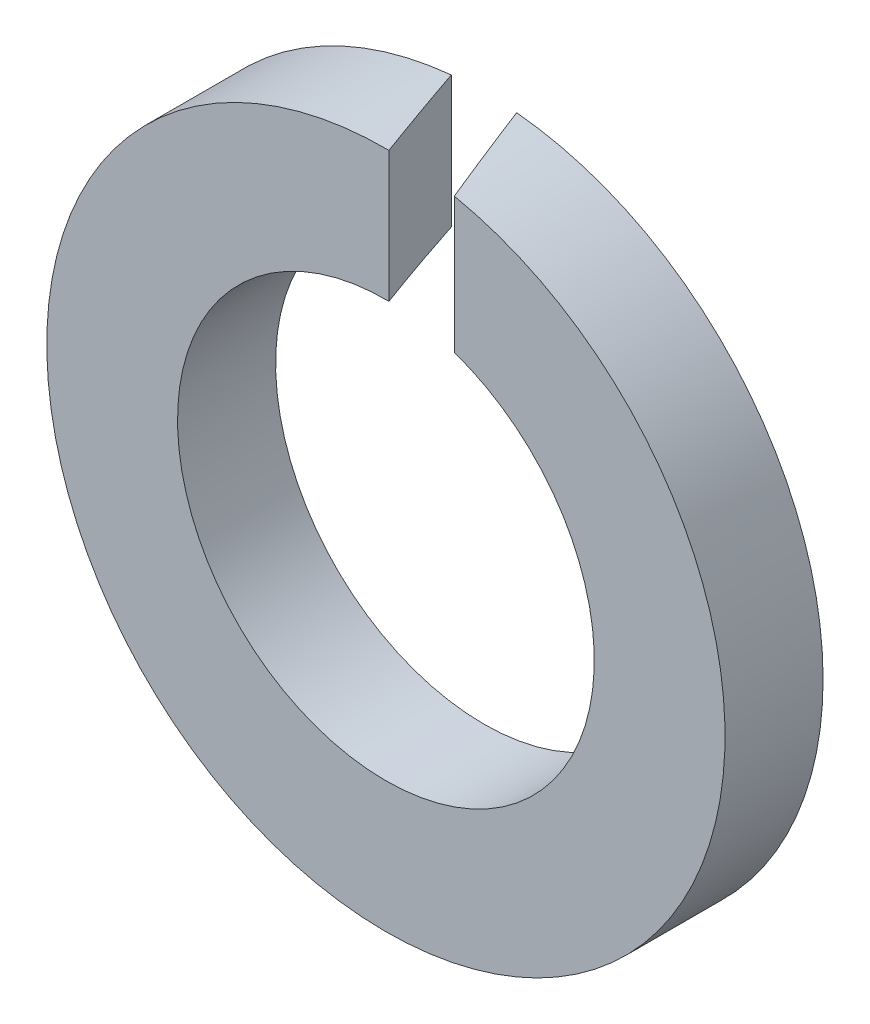
ISO-10303-21;
HEADER;
FILE_DESCRIPTION(('STEP AP214'),'2;1');
FILE_NAME('part.step','',(''),(''),'','','');
FILE_SCHEMA(('AUTOMOTIVE_DESIGN { 1 0 10303 214 1 1 1 1 }'));
ENDSEC;
DATA;
#1=APPLICATION_CONTEXT('core data for automotive mechanical design processes');
#2=APPLICATION_PROTOCOL_DEFINITION('international standard','automotive_design',2000,#1);
#3=PRODUCT_CONTEXT('',#1,'mechanical');
#4=PRODUCT('Part','Part','',(#3));
#5=PRODUCT_RELATED_PRODUCT_CATEGORY('part','',(#4));
#6=PRODUCT_DEFINITION_FORMATION('','',#4);
#7=PRODUCT_DEFINITION_CONTEXT('part definition',#1,'design');
#8=PRODUCT_DEFINITION('design','',#6,#7);
#9=PRODUCT_DEFINITION_SHAPE('','',#8);
#10=(LENGTH_UNIT() NAMED_UNIT(*) SI_UNIT(.MILLI.,.METRE.));
#11=(NAMED_UNIT(*) PLANE_ANGLE_UNIT() SI_UNIT($,.RADIAN.));
#12=(NAMED_UNIT(*) SI_UNIT($,.STERADIAN.) SOLID_ANGLE_UNIT());
#13=UNCERTAINTY_MEASURE_WITH_UNIT(LENGTH_MEASURE(1.E-05),#10,'distance_accuracy_value','');
#14=(GEOMETRIC_REPRESENTATION_CONTEXT(3) GLOBAL_UNCERTAINTY_ASSIGNED_CONTEXT((#13)) GLOBAL_UNIT_ASSIGNED_CONTEXT((#10,
#11,#12)) REPRESENTATION_CONTEXT('',''));
#15=CARTESIAN_POINT('',(0.,0.,0.));
#16=DIRECTION('',(0.,0.,1.));
#17=DIRECTION('',(1.,0.,0.));
#18=AXIS2_PLACEMENT_3D('',#15,#16,#17);
#19=CARTESIAN_POINT('',(0.,0.,1.2));
#20=DIRECTION('',(0.,0.,1.));
#21=DIRECTION('',(1.,0.,0.));
#22=AXIS2_PLACEMENT_3D('',#19,#20,#21);
#23=PLANE('',#22);
#24=CARTESIAN_POINT('',(0.,0.,1.2));
#25=DIRECTION('',(0.,0.,1.));
#26=DIRECTION('',(1.,0.,0.));
#27=AXIS2_PLACEMENT_3D('',#24,#25,#26);
#28=CIRCLE('',#27,4.15);
#29=CARTESIAN_POINT('',(0.036764281119422,4.14983715194148,1.2));
#30=VERTEX_POINT('',#29);
#31=CARTESIAN_POINT('',(0.836764281119425,4.06476635710377,1.2));
#32=VERTEX_POINT('',#31);
#33=EDGE_CURVE('E81',#30,#32,#28,.T.);
#34=ORIENTED_EDGE('',*,*,#33,.T.);
#35=DIRECTION('',(0.,-1.,0.));
#36=VECTOR('',#35,1.);
#37=CARTESIAN_POINT('',(0.836764281119425,0.,1.2));
#38=LINE('',#37,#36);
#39=CARTESIAN_POINT('',(0.836764281119425,2.40880168088672,1.2));
#40=VERTEX_POINT('',#39);
#41=EDGE_CURVE('E101',#32,#40,#38,.T.);
#42=ORIENTED_EDGE('',*,*,#41,.T.);
#43=CARTESIAN_POINT('',(0.,0.,1.2));
#44=DIRECTION('',(0.,0.,1.));
#45=DIRECTION('',(1.,0.,0.));
#46=AXIS2_PLACEMENT_3D('',#43,#44,#45);
#47=CIRCLE('',#46,2.55);
#48=CARTESIAN_POINT('',(0.036764281119422,2.54973496419408,1.2));
#49=VERTEX_POINT('',#48);
#50=EDGE_CURVE('E92',#49,#40,#47,.T.);
#51=ORIENTED_EDGE('',*,*,#50,.F.);
#52=DIRECTION('',(0.,1.,0.));
#53=VECTOR('',#52,1.);
#54=CARTESIAN_POINT('',(0.036764281119422,0.,1.2));
#55=LINE('',#54,#53);
#56=EDGE_CURVE('E58',#49,#30,#55,.T.);
#57=ORIENTED_EDGE('',*,*,#56,.T.);
#58=EDGE_LOOP('',(#34,#42,#51,#57));
#59=FACE_BOUND('',#58,.T.);
#60=ADVANCED_FACE('F36',(#59),#23,.T.);
#61=CARTESIAN_POINT('',(0.,0.,0.));
#62=DIRECTION('',(0.,0.,1.));
#63=DIRECTION('',(1.,0.,0.));
#64=AXIS2_PLACEMENT_3D('',#61,#62,#63);
#65=PLANE('',#64);
#66=DIRECTION('',(0.,-1.,0.));
#67=VECTOR('',#66,1.);
#68=CARTESIAN_POINT('',(0.399999999999976,0.,0.));
#69=LINE('',#68,#67);
#70=CARTESIAN_POINT('',(0.399999999999976,4.13067791046458,0.));
#71=VERTEX_POINT('',#70);
#72=CARTESIAN_POINT('',(0.399999999999976,2.51843205189261,0.));
#73=VERTEX_POINT('',#72);
#74=EDGE_CURVE('E51',#71,#73,#69,.T.);
#75=ORIENTED_EDGE('',*,*,#74,.F.);
#76=CARTESIAN_POINT('',(0.,0.,0.));
#77=DIRECTION('',(0.,0.,1.));
#78=DIRECTION('',(1.,0.,0.));
#79=AXIS2_PLACEMENT_3D('',#76,#77,#78);
#80=CIRCLE('',#79,4.15);
#81=CARTESIAN_POINT('',(-0.400000000000027,4.13067791046457,0.));
#82=VERTEX_POINT('',#81);
#83=EDGE_CURVE('E88',#82,#71,#80,.T.);
#84=ORIENTED_EDGE('',*,*,#83,.F.);
#85=DIRECTION('',(0.,1.,0.));
#86=VECTOR('',#85,1.);
#87=CARTESIAN_POINT('',(-0.400000000000027,0.,0.));
#88=LINE('',#87,#86);
#89=CARTESIAN_POINT('',(-0.400000000000027,2.5184320518926,0.));
#90=VERTEX_POINT('',#89);
#91=EDGE_CURVE('E75',#90,#82,#88,.T.);
#92=ORIENTED_EDGE('',*,*,#91,.F.);
#93=CARTESIAN_POINT('',(0.,0.,0.));
#94=DIRECTION('',(0.,0.,1.));
#95=DIRECTION('',(1.,0.,0.));
#96=AXIS2_PLACEMENT_3D('',#93,#94,#95);
#97=CIRCLE('',#96,2.55);
#98=EDGE_CURVE('E86',#90,#73,#97,.T.);
#99=ORIENTED_EDGE('',*,*,#98,.T.);
#100=EDGE_LOOP('',(#75,#84,#92,#99));
#101=FACE_BOUND('',#100,.T.);
#102=ADVANCED_FACE('F85',(#101),#65,.F.);
#103=CARTESIAN_POINT('',(0.,0.,1.2));
#104=DIRECTION('',(0.,0.,-1.));
#105=DIRECTION('',(-1.,0.,0.));
#106=AXIS2_PLACEMENT_3D('',#103,#104,#105);
#107=CYLINDRICAL_SURFACE('',#106,4.15);
#108=CARTESIAN_POINT('',(0.,0.,-1.09899096778177));
#109=DIRECTION('',(-0.939692620785907,0.,0.342020143325673));
#110=DIRECTION('',(-0.342020143325673,0.,-0.939692620785907));
#111=AXIS2_PLACEMENT_3D('',#108,#109,#110);
#112=ELLIPSE('',#111,12.1337882606767,4.15);
#113=EDGE_CURVE('E93',#32,#71,#112,.T.);
#114=ORIENTED_EDGE('',*,*,#113,.F.);
#115=ORIENTED_EDGE('',*,*,#33,.F.);
#116=CARTESIAN_POINT('',(0.,0.,1.09899096778191));
#117=DIRECTION('',(0.939692620785907,0.,-0.342020143325673));
#118=DIRECTION('',(-0.342020143325673,0.,-0.939692620785907));
#119=AXIS2_PLACEMENT_3D('',#116,#117,#118);
#120=ELLIPSE('',#119,12.1337882606767,4.15);
#121=EDGE_CURVE('E110',#82,#30,#120,.T.);
#122=ORIENTED_EDGE('',*,*,#121,.F.);
#123=ORIENTED_EDGE('',*,*,#83,.T.);
#124=EDGE_LOOP('',(#114,#115,#122,#123));
#125=FACE_BOUND('',#124,.T.);
#126=ADVANCED_FACE('F38',(#125),#107,.T.);
#127=CARTESIAN_POINT('',(0.,0.,1.2));
#128=DIRECTION('',(0.,0.,-1.));
#129=DIRECTION('',(-1.,0.,0.));
#130=AXIS2_PLACEMENT_3D('',#127,#128,#129);
#131=CYLINDRICAL_SURFACE('',#130,2.55);
#132=ORIENTED_EDGE('',*,*,#50,.T.);
#133=CARTESIAN_POINT('',(0.,0.,-1.09899096778177));
#134=DIRECTION('',(-0.939692620785907,0.,0.342020143325673));
#135=DIRECTION('',(-0.342020143325673,0.,-0.939692620785907));
#136=AXIS2_PLACEMENT_3D('',#133,#134,#135);
#137=ELLIPSE('',#136,7.45570122041578,2.55);
#138=EDGE_CURVE('E11',#40,#73,#137,.T.);
#139=ORIENTED_EDGE('',*,*,#138,.T.);
#140=ORIENTED_EDGE('',*,*,#98,.F.);
#141=CARTESIAN_POINT('',(0.,0.,1.09899096778191));
#142=DIRECTION('',(0.939692620785907,0.,-0.342020143325673));
#143=DIRECTION('',(-0.342020143325673,0.,-0.939692620785907));
#144=AXIS2_PLACEMENT_3D('',#141,#142,#143);
#145=ELLIPSE('',#144,7.45570122041578,2.55);
#146=EDGE_CURVE('E44',#90,#49,#145,.T.);
#147=ORIENTED_EDGE('',*,*,#146,.T.);
#148=EDGE_LOOP('',(#132,#139,#140,#147));
#149=FACE_BOUND('',#148,.T.);
#150=ADVANCED_FACE('F90',(#149),#131,.F.);
#151=CARTESIAN_POINT('',(0.772221758200914,4.15,3.22065281125044));
#152=DIRECTION('',(0.939692620785907,0.,-0.342020143325673));
#153=DIRECTION('',(-0.342020143325673,0.,-0.939692620785907));
#154=AXIS2_PLACEMENT_3D('',#151,#152,#153);
#155=PLANE('',#154);
#156=ORIENTED_EDGE('',*,*,#121,.T.);
#157=ORIENTED_EDGE('',*,*,#56,.F.);
#158=ORIENTED_EDGE('',*,*,#146,.F.);
#159=ORIENTED_EDGE('',*,*,#91,.T.);
#160=EDGE_LOOP('',(#156,#157,#158,#159));
#161=FACE_BOUND('',#160,.T.);
#162=ADVANCED_FACE('F74',(#161),#155,.T.);
#163=CARTESIAN_POINT('',(1.48383310567363,4.15,2.97780698429571));
#164=DIRECTION('',(-0.939692620785907,0.,0.342020143325673));
#165=DIRECTION('',(0.342020143325673,0.,0.939692620785907));
#166=AXIS2_PLACEMENT_3D('',#163,#164,#165);
#167=PLANE('',#166);
#168=ORIENTED_EDGE('',*,*,#113,.T.);
#169=ORIENTED_EDGE('',*,*,#74,.T.);
#170=ORIENTED_EDGE('',*,*,#138,.F.);
#171=ORIENTED_EDGE('',*,*,#41,.F.);
#172=EDGE_LOOP('',(#168,#169,#170,#171));
#173=FACE_BOUND('',#172,.T.);
#174=ADVANCED_FACE('F117',(#173),#167,.T.);
#175=CLOSED_SHELL('',(#60,#102,#126,#150,#162,#174));
#176=MANIFOLD_SOLID_BREP('B2',#175);
#177=ADVANCED_BREP_SHAPE_REPRESENTATION('',(#18,#176),#14);
#178=SHAPE_DEFINITION_REPRESENTATION(#9,#177);
ENDSEC;
END-ISO-10303-21;
